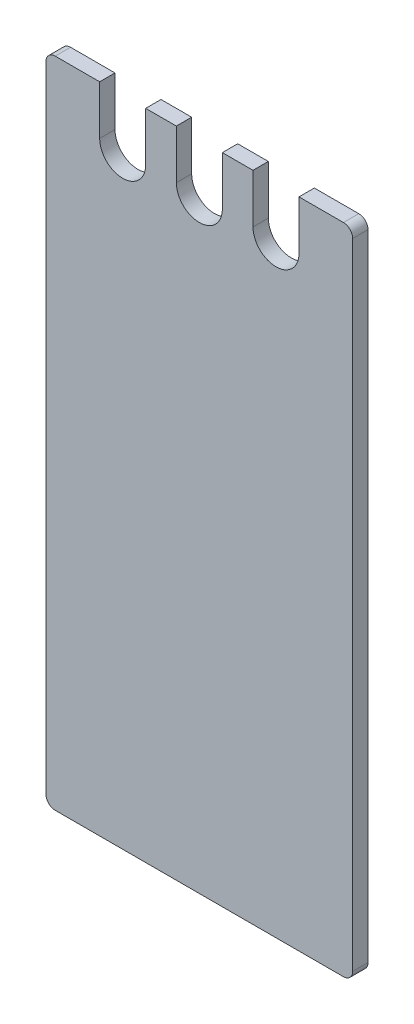
ISO-10303-21;
HEADER;
FILE_DESCRIPTION(('STEP AP214'),'2;1');
FILE_NAME('part.step','',(''),(''),'','','');
FILE_SCHEMA(('AUTOMOTIVE_DESIGN { 1 0 10303 214 1 1 1 1 }'));
ENDSEC;
DATA;
#1=APPLICATION_CONTEXT('core data for automotive mechanical design processes');
#2=APPLICATION_PROTOCOL_DEFINITION('international standard','automotive_design',2000,#1);
#3=PRODUCT_CONTEXT('',#1,'mechanical');
#4=PRODUCT('Part','Part','',(#3));
#5=PRODUCT_RELATED_PRODUCT_CATEGORY('part','',(#4));
#6=PRODUCT_DEFINITION_FORMATION('','',#4);
#7=PRODUCT_DEFINITION_CONTEXT('part definition',#1,'design');
#8=PRODUCT_DEFINITION('design','',#6,#7);
#9=PRODUCT_DEFINITION_SHAPE('','',#8);
#10=(LENGTH_UNIT() NAMED_UNIT(*) SI_UNIT(.MILLI.,.METRE.));
#11=(NAMED_UNIT(*) PLANE_ANGLE_UNIT() SI_UNIT($,.RADIAN.));
#12=(NAMED_UNIT(*) SI_UNIT($,.STERADIAN.) SOLID_ANGLE_UNIT());
#13=UNCERTAINTY_MEASURE_WITH_UNIT(LENGTH_MEASURE(1.E-05),#10,'distance_accuracy_value','');
#14=(GEOMETRIC_REPRESENTATION_CONTEXT(3) GLOBAL_UNCERTAINTY_ASSIGNED_CONTEXT((#13)) GLOBAL_UNIT_ASSIGNED_CONTEXT((#10,
#11,#12)) REPRESENTATION_CONTEXT('',''));
#15=CARTESIAN_POINT('',(0.,0.,0.));
#16=DIRECTION('',(0.,0.,1.));
#17=DIRECTION('',(1.,0.,0.));
#18=AXIS2_PLACEMENT_3D('',#15,#16,#17);
#19=CARTESIAN_POINT('',(-7.49999999999998,213.,2.5));
#20=DIRECTION('',(-1.,0.,0.));
#21=DIRECTION('',(0.,-1.,0.));
#22=AXIS2_PLACEMENT_3D('',#19,#20,#21);
#23=PLANE('',#22);
#24=DIRECTION('',(0.,1.,0.));
#25=VECTOR('',#24,1.);
#26=CARTESIAN_POINT('',(-7.49999999999998,213.,-2.5));
#27=LINE('',#26,#25);
#28=CARTESIAN_POINT('',(-7.5,197.,-2.5));
#29=VERTEX_POINT('',#28);
#30=CARTESIAN_POINT('',(-7.49999999999998,213.,-2.5));
#31=VERTEX_POINT('',#30);
#32=EDGE_CURVE('E195',#29,#31,#27,.T.);
#33=ORIENTED_EDGE('',*,*,#32,.T.);
#34=DIRECTION('',(0.,0.,-1.));
#35=VECTOR('',#34,1.);
#36=CARTESIAN_POINT('',(-7.49999999999998,213.,2.5));
#37=LINE('',#36,#35);
#38=CARTESIAN_POINT('',(-7.49999999999998,213.,2.5));
#39=VERTEX_POINT('',#38);
#40=EDGE_CURVE('E176',#39,#31,#37,.T.);
#41=ORIENTED_EDGE('',*,*,#40,.F.);
#42=DIRECTION('',(0.,1.,0.));
#43=VECTOR('',#42,1.);
#44=CARTESIAN_POINT('',(-7.49999999999998,213.,2.5));
#45=LINE('',#44,#43);
#46=CARTESIAN_POINT('',(-7.5,197.,2.5));
#47=VERTEX_POINT('',#46);
#48=EDGE_CURVE('E182',#47,#39,#45,.T.);
#49=ORIENTED_EDGE('',*,*,#48,.F.);
#50=DIRECTION('',(0.,0.,-1.));
#51=VECTOR('',#50,1.);
#52=CARTESIAN_POINT('',(-7.5,197.,2.5));
#53=LINE('',#52,#51);
#54=EDGE_CURVE('E283',#47,#29,#53,.T.);
#55=ORIENTED_EDGE('',*,*,#54,.T.);
#56=EDGE_LOOP('',(#33,#41,#49,#55));
#57=FACE_BOUND('',#56,.T.);
#58=ADVANCED_FACE('F34',(#57),#23,.F.);
#59=CARTESIAN_POINT('',(-7.49999999999998,213.,2.5));
#60=DIRECTION('',(0.,-1.,0.));
#61=DIRECTION('',(1.,0.,0.));
#62=AXIS2_PLACEMENT_3D('',#59,#60,#61);
#63=PLANE('',#62);
#64=DIRECTION('',(-1.,0.,0.));
#65=VECTOR('',#64,1.);
#66=CARTESIAN_POINT('',(-7.49999999999998,213.,-2.5));
#67=LINE('',#66,#65);
#68=CARTESIAN_POINT('',(-17.5,213.,-2.5));
#69=VERTEX_POINT('',#68);
#70=EDGE_CURVE('E321',#31,#69,#67,.T.);
#71=ORIENTED_EDGE('',*,*,#70,.T.);
#72=DIRECTION('',(0.,0.,-1.));
#73=VECTOR('',#72,1.);
#74=CARTESIAN_POINT('',(-17.5,213.,2.5));
#75=LINE('',#74,#73);
#76=CARTESIAN_POINT('',(-17.5,213.,2.5));
#77=VERTEX_POINT('',#76);
#78=EDGE_CURVE('E179',#77,#69,#75,.T.);
#79=ORIENTED_EDGE('',*,*,#78,.F.);
#80=DIRECTION('',(-1.,0.,0.));
#81=VECTOR('',#80,1.);
#82=CARTESIAN_POINT('',(-7.49999999999998,213.,2.5));
#83=LINE('',#82,#81);
#84=EDGE_CURVE('E172',#39,#77,#83,.T.);
#85=ORIENTED_EDGE('',*,*,#84,.F.);
#86=ORIENTED_EDGE('',*,*,#40,.T.);
#87=EDGE_LOOP('',(#71,#79,#85,#86));
#88=FACE_BOUND('',#87,.T.);
#89=ADVANCED_FACE('F174',(#88),#63,.F.);
#90=CARTESIAN_POINT('',(-17.5,213.,2.5));
#91=DIRECTION('',(1.,0.,0.));
#92=DIRECTION('',(0.,0.,-1.));
#93=AXIS2_PLACEMENT_3D('',#90,#91,#92);
#94=PLANE('',#93);
#95=DIRECTION('',(0.,-1.,0.));
#96=VECTOR('',#95,1.);
#97=CARTESIAN_POINT('',(-17.5,213.,-2.5));
#98=LINE('',#97,#96);
#99=CARTESIAN_POINT('',(-17.5,197.,-2.5));
#100=VERTEX_POINT('',#99);
#101=EDGE_CURVE('E319',#69,#100,#98,.T.);
#102=ORIENTED_EDGE('',*,*,#101,.T.);
#103=DIRECTION('',(0.,0.,-1.));
#104=VECTOR('',#103,1.);
#105=CARTESIAN_POINT('',(-17.5,197.,2.5));
#106=LINE('',#105,#104);
#107=CARTESIAN_POINT('',(-17.5,197.,2.5));
#108=VERTEX_POINT('',#107);
#109=EDGE_CURVE('E201',#108,#100,#106,.T.);
#110=ORIENTED_EDGE('',*,*,#109,.F.);
#111=DIRECTION('',(0.,-1.,0.));
#112=VECTOR('',#111,1.);
#113=CARTESIAN_POINT('',(-17.5,213.,2.5));
#114=LINE('',#113,#112);
#115=EDGE_CURVE('E181',#77,#108,#114,.T.);
#116=ORIENTED_EDGE('',*,*,#115,.F.);
#117=ORIENTED_EDGE('',*,*,#78,.T.);
#118=EDGE_LOOP('',(#102,#110,#116,#117));
#119=FACE_BOUND('',#118,.T.);
#120=ADVANCED_FACE('F346',(#119),#94,.F.);
#121=CARTESIAN_POINT('',(-25.,197.,2.5));
#122=DIRECTION('',(0.,0.,-1.));
#123=DIRECTION('',(-1.,0.,0.));
#124=AXIS2_PLACEMENT_3D('',#121,#122,#123);
#125=CYLINDRICAL_SURFACE('',#124,7.5);
#126=CARTESIAN_POINT('',(-25.,197.,-2.5));
#127=DIRECTION('',(0.,0.,-1.));
#128=DIRECTION('',(1.,0.,0.));
#129=AXIS2_PLACEMENT_3D('',#126,#127,#128);
#130=CIRCLE('',#129,7.5);
#131=CARTESIAN_POINT('',(-32.5,197.,-2.5));
#132=VERTEX_POINT('',#131);
#133=EDGE_CURVE('E314',#100,#132,#130,.T.);
#134=ORIENTED_EDGE('',*,*,#133,.T.);
#135=DIRECTION('',(0.,0.,-1.));
#136=VECTOR('',#135,1.);
#137=CARTESIAN_POINT('',(-32.5,197.,2.5));
#138=LINE('',#137,#136);
#139=CARTESIAN_POINT('',(-32.5,197.,2.5));
#140=VERTEX_POINT('',#139);
#141=EDGE_CURVE('E305',#140,#132,#138,.T.);
#142=ORIENTED_EDGE('',*,*,#141,.F.);
#143=CARTESIAN_POINT('',(-25.,197.,2.5));
#144=DIRECTION('',(0.,0.,-1.));
#145=DIRECTION('',(1.,0.,0.));
#146=AXIS2_PLACEMENT_3D('',#143,#144,#145);
#147=CIRCLE('',#146,7.5);
#148=EDGE_CURVE('E315',#108,#140,#147,.T.);
#149=ORIENTED_EDGE('',*,*,#148,.F.);
#150=ORIENTED_EDGE('',*,*,#109,.T.);
#151=EDGE_LOOP('',(#134,#142,#149,#150));
#152=FACE_BOUND('',#151,.T.);
#153=ADVANCED_FACE('F312',(#152),#125,.F.);
#154=CARTESIAN_POINT('',(-32.5,213.,2.5));
#155=DIRECTION('',(-1.,0.,0.));
#156=DIRECTION('',(0.,-1.,0.));
#157=AXIS2_PLACEMENT_3D('',#154,#155,#156);
#158=PLANE('',#157);
#159=DIRECTION('',(0.,1.,0.));
#160=VECTOR('',#159,1.);
#161=CARTESIAN_POINT('',(-32.5,213.,-2.5));
#162=LINE('',#161,#160);
#163=CARTESIAN_POINT('',(-32.5,213.,-2.5));
#164=VERTEX_POINT('',#163);
#165=EDGE_CURVE('E264',#132,#164,#162,.T.);
#166=ORIENTED_EDGE('',*,*,#165,.T.);
#167=DIRECTION('',(0.,0.,-1.));
#168=VECTOR('',#167,1.);
#169=CARTESIAN_POINT('',(-32.5,213.,2.5));
#170=LINE('',#169,#168);
#171=CARTESIAN_POINT('',(-32.5,213.,2.5));
#172=VERTEX_POINT('',#171);
#173=EDGE_CURVE('E303',#172,#164,#170,.T.);
#174=ORIENTED_EDGE('',*,*,#173,.F.);
#175=DIRECTION('',(0.,1.,0.));
#176=VECTOR('',#175,1.);
#177=CARTESIAN_POINT('',(-32.5,213.,2.5));
#178=LINE('',#177,#176);
#179=EDGE_CURVE('E244',#140,#172,#178,.T.);
#180=ORIENTED_EDGE('',*,*,#179,.F.);
#181=ORIENTED_EDGE('',*,*,#141,.T.);
#182=EDGE_LOOP('',(#166,#174,#180,#181));
#183=FACE_BOUND('',#182,.T.);
#184=ADVANCED_FACE('F353',(#183),#158,.F.);
#185=CARTESIAN_POINT('',(-32.5,213.,2.5));
#186=DIRECTION('',(0.,-1.,0.));
#187=DIRECTION('',(1.,0.,0.));
#188=AXIS2_PLACEMENT_3D('',#185,#186,#187);
#189=PLANE('',#188);
#190=DIRECTION('',(-1.,0.,0.));
#191=VECTOR('',#190,1.);
#192=CARTESIAN_POINT('',(-32.5,213.,-2.5));
#193=LINE('',#192,#191);
#194=CARTESIAN_POINT('',(-47.,213.,-2.5));
#195=VERTEX_POINT('',#194);
#196=EDGE_CURVE('E239',#164,#195,#193,.T.);
#197=ORIENTED_EDGE('',*,*,#196,.T.);
#198=DIRECTION('',(0.,0.,-1.));
#199=VECTOR('',#198,1.);
#200=CARTESIAN_POINT('',(-47.,213.,2.5));
#201=LINE('',#200,#199);
#202=CARTESIAN_POINT('',(-47.,213.,2.5));
#203=VERTEX_POINT('',#202);
#204=EDGE_CURVE('E229',#195,#203,#201,.F.);
#205=ORIENTED_EDGE('',*,*,#204,.T.);
#206=DIRECTION('',(-1.,0.,0.));
#207=VECTOR('',#206,1.);
#208=CARTESIAN_POINT('',(-32.5,213.,2.5));
#209=LINE('',#208,#207);
#210=EDGE_CURVE('E237',#172,#203,#209,.T.);
#211=ORIENTED_EDGE('',*,*,#210,.F.);
#212=ORIENTED_EDGE('',*,*,#173,.T.);
#213=EDGE_LOOP('',(#197,#205,#211,#212));
#214=FACE_BOUND('',#213,.T.);
#215=ADVANCED_FACE('F235',(#214),#189,.F.);
#216=CARTESIAN_POINT('',(-50.,213.,2.5));
#217=DIRECTION('',(1.,0.,0.));
#218=DIRECTION('',(0.,0.,-1.));
#219=AXIS2_PLACEMENT_3D('',#216,#217,#218);
#220=PLANE('',#219);
#221=DIRECTION('',(0.,-1.,0.));
#222=VECTOR('',#221,1.);
#223=CARTESIAN_POINT('',(-50.,213.,2.5));
#224=LINE('',#223,#222);
#225=CARTESIAN_POINT('',(-50.,210.,2.5));
#226=VERTEX_POINT('',#225);
#227=CARTESIAN_POINT('',(-50.,3.,2.5));
#228=VERTEX_POINT('',#227);
#229=EDGE_CURVE('E246',#226,#228,#224,.T.);
#230=ORIENTED_EDGE('',*,*,#229,.F.);
#231=DIRECTION('',(0.,0.,-1.));
#232=VECTOR('',#231,1.);
#233=CARTESIAN_POINT('',(-50.,210.,2.5));
#234=LINE('',#233,#232);
#235=CARTESIAN_POINT('',(-50.,210.,-2.5));
#236=VERTEX_POINT('',#235);
#237=EDGE_CURVE('E226',#226,#236,#234,.T.);
#238=ORIENTED_EDGE('',*,*,#237,.T.);
#239=DIRECTION('',(0.,-1.,0.));
#240=VECTOR('',#239,1.);
#241=CARTESIAN_POINT('',(-50.,213.,-2.5));
#242=LINE('',#241,#240);
#243=CARTESIAN_POINT('',(-50.,3.,-2.5));
#244=VERTEX_POINT('',#243);
#245=EDGE_CURVE('E254',#236,#244,#242,.T.);
#246=ORIENTED_EDGE('',*,*,#245,.T.);
#247=DIRECTION('',(0.,0.,-1.));
#248=VECTOR('',#247,1.);
#249=CARTESIAN_POINT('',(-50.,3.,2.5));
#250=LINE('',#249,#248);
#251=EDGE_CURVE('E224',#244,#228,#250,.F.);
#252=ORIENTED_EDGE('',*,*,#251,.T.);
#253=EDGE_LOOP('',(#230,#238,#246,#252));
#254=FACE_BOUND('',#253,.T.);
#255=ADVANCED_FACE('F253',(#254),#220,.F.);
#256=CARTESIAN_POINT('',(-50.,0.,2.5));
#257=DIRECTION('',(0.,1.,0.));
#258=DIRECTION('',(0.,0.,1.));
#259=AXIS2_PLACEMENT_3D('',#256,#257,#258);
#260=PLANE('',#259);
#261=DIRECTION('',(1.,0.,0.));
#262=VECTOR('',#261,1.);
#263=CARTESIAN_POINT('',(-50.,0.,2.5));
#264=LINE('',#263,#262);
#265=CARTESIAN_POINT('',(-47.,0.,2.5));
#266=VERTEX_POINT('',#265);
#267=CARTESIAN_POINT('',(47.,0.,2.5));
#268=VERTEX_POINT('',#267);
#269=EDGE_CURVE('E341',#266,#268,#264,.T.);
#270=ORIENTED_EDGE('',*,*,#269,.F.);
#271=DIRECTION('',(0.,0.,-1.));
#272=VECTOR('',#271,1.);
#273=CARTESIAN_POINT('',(-47.,0.,2.5));
#274=LINE('',#273,#272);
#275=CARTESIAN_POINT('',(-47.,0.,-2.5));
#276=VERTEX_POINT('',#275);
#277=EDGE_CURVE('E11',#266,#276,#274,.T.);
#278=ORIENTED_EDGE('',*,*,#277,.T.);
#279=DIRECTION('',(1.,0.,0.));
#280=VECTOR('',#279,1.);
#281=CARTESIAN_POINT('',(-50.,0.,-2.5));
#282=LINE('',#281,#280);
#283=CARTESIAN_POINT('',(47.,0.,-2.5));
#284=VERTEX_POINT('',#283);
#285=EDGE_CURVE('E260',#276,#284,#282,.T.);
#286=ORIENTED_EDGE('',*,*,#285,.T.);
#287=DIRECTION('',(0.,0.,-1.));
#288=VECTOR('',#287,1.);
#289=CARTESIAN_POINT('',(47.,0.,2.5));
#290=LINE('',#289,#288);
#291=EDGE_CURVE('E42',#284,#268,#290,.F.);
#292=ORIENTED_EDGE('',*,*,#291,.T.);
#293=EDGE_LOOP('',(#270,#278,#286,#292));
#294=FACE_BOUND('',#293,.T.);
#295=ADVANCED_FACE('F374',(#294),#260,.F.);
#296=CARTESIAN_POINT('',(50.,0.,2.5));
#297=DIRECTION('',(-1.,0.,0.));
#298=DIRECTION('',(0.,0.,1.));
#299=AXIS2_PLACEMENT_3D('',#296,#297,#298);
#300=PLANE('',#299);
#301=DIRECTION('',(0.,1.,0.));
#302=VECTOR('',#301,1.);
#303=CARTESIAN_POINT('',(50.,0.,-2.5));
#304=LINE('',#303,#302);
#305=CARTESIAN_POINT('',(50.,3.,-2.5));
#306=VERTEX_POINT('',#305);
#307=CARTESIAN_POINT('',(50.,210.,-2.5));
#308=VERTEX_POINT('',#307);
#309=EDGE_CURVE('E262',#306,#308,#304,.T.);
#310=ORIENTED_EDGE('',*,*,#309,.T.);
#311=DIRECTION('',(0.,0.,-1.));
#312=VECTOR('',#311,1.);
#313=CARTESIAN_POINT('',(50.,210.,2.5));
#314=LINE('',#313,#312);
#315=CARTESIAN_POINT('',(50.,210.,2.5));
#316=VERTEX_POINT('',#315);
#317=EDGE_CURVE('E215',#308,#316,#314,.F.);
#318=ORIENTED_EDGE('',*,*,#317,.T.);
#319=DIRECTION('',(0.,1.,0.));
#320=VECTOR('',#319,1.);
#321=CARTESIAN_POINT('',(50.,0.,2.5));
#322=LINE('',#321,#320);
#323=CARTESIAN_POINT('',(50.,3.,2.5));
#324=VERTEX_POINT('',#323);
#325=EDGE_CURVE('E339',#324,#316,#322,.T.);
#326=ORIENTED_EDGE('',*,*,#325,.F.);
#327=DIRECTION('',(0.,0.,-1.));
#328=VECTOR('',#327,1.);
#329=CARTESIAN_POINT('',(50.,3.,2.5));
#330=LINE('',#329,#328);
#331=EDGE_CURVE('E212',#324,#306,#330,.T.);
#332=ORIENTED_EDGE('',*,*,#331,.T.);
#333=EDGE_LOOP('',(#310,#318,#326,#332));
#334=FACE_BOUND('',#333,.T.);
#335=ADVANCED_FACE('F380',(#334),#300,.F.);
#336=CARTESIAN_POINT('',(32.5,213.,2.5));
#337=DIRECTION('',(0.,-1.,0.));
#338=DIRECTION('',(0.,0.,-1.));
#339=AXIS2_PLACEMENT_3D('',#336,#337,#338);
#340=PLANE('',#339);
#341=DIRECTION('',(-1.,0.,0.));
#342=VECTOR('',#341,1.);
#343=CARTESIAN_POINT('',(32.5,213.,2.5));
#344=LINE('',#343,#342);
#345=CARTESIAN_POINT('',(47.,213.,2.5));
#346=VERTEX_POINT('',#345);
#347=CARTESIAN_POINT('',(32.5,213.,2.5));
#348=VERTEX_POINT('',#347);
#349=EDGE_CURVE('E337',#346,#348,#344,.T.);
#350=ORIENTED_EDGE('',*,*,#349,.F.);
#351=DIRECTION('',(0.,0.,-1.));
#352=VECTOR('',#351,1.);
#353=CARTESIAN_POINT('',(47.,213.,2.5));
#354=LINE('',#353,#352);
#355=CARTESIAN_POINT('',(47.,213.,-2.5));
#356=VERTEX_POINT('',#355);
#357=EDGE_CURVE('E196',#346,#356,#354,.T.);
#358=ORIENTED_EDGE('',*,*,#357,.T.);
#359=DIRECTION('',(-1.,0.,0.));
#360=VECTOR('',#359,1.);
#361=CARTESIAN_POINT('',(32.5,213.,-2.5));
#362=LINE('',#361,#360);
#363=CARTESIAN_POINT('',(32.5,213.,-2.5));
#364=VERTEX_POINT('',#363);
#365=EDGE_CURVE('E270',#356,#364,#362,.T.);
#366=ORIENTED_EDGE('',*,*,#365,.T.);
#367=DIRECTION('',(0.,0.,-1.));
#368=VECTOR('',#367,1.);
#369=CARTESIAN_POINT('',(32.5,213.,2.5));
#370=LINE('',#369,#368);
#371=EDGE_CURVE('E300',#348,#364,#370,.T.);
#372=ORIENTED_EDGE('',*,*,#371,.F.);
#373=EDGE_LOOP('',(#350,#358,#366,#372));
#374=FACE_BOUND('',#373,.T.);
#375=ADVANCED_FACE('F386',(#374),#340,.F.);
#376=CARTESIAN_POINT('',(32.5,213.,2.5));
#377=DIRECTION('',(1.,0.,0.));
#378=DIRECTION('',(0.,0.,-1.));
#379=AXIS2_PLACEMENT_3D('',#376,#377,#378);
#380=PLANE('',#379);
#381=DIRECTION('',(0.,-1.,0.));
#382=VECTOR('',#381,1.);
#383=CARTESIAN_POINT('',(32.5,213.,-2.5));
#384=LINE('',#383,#382);
#385=CARTESIAN_POINT('',(32.5,197.,-2.5));
#386=VERTEX_POINT('',#385);
#387=EDGE_CURVE('E272',#364,#386,#384,.T.);
#388=ORIENTED_EDGE('',*,*,#387,.T.);
#389=DIRECTION('',(0.,0.,-1.));
#390=VECTOR('',#389,1.);
#391=CARTESIAN_POINT('',(32.5,197.,2.5));
#392=LINE('',#391,#390);
#393=CARTESIAN_POINT('',(32.5,197.,2.5));
#394=VERTEX_POINT('',#393);
#395=EDGE_CURVE('E297',#394,#386,#392,.T.);
#396=ORIENTED_EDGE('',*,*,#395,.F.);
#397=DIRECTION('',(0.,-1.,0.));
#398=VECTOR('',#397,1.);
#399=CARTESIAN_POINT('',(32.5,213.,2.5));
#400=LINE('',#399,#398);
#401=EDGE_CURVE('E335',#348,#394,#400,.T.);
#402=ORIENTED_EDGE('',*,*,#401,.F.);
#403=ORIENTED_EDGE('',*,*,#371,.T.);
#404=EDGE_LOOP('',(#388,#396,#402,#403));
#405=FACE_BOUND('',#404,.T.);
#406=ADVANCED_FACE('F393',(#405),#380,.F.);
#407=CARTESIAN_POINT('',(25.,197.,2.5));
#408=DIRECTION('',(0.,0.,-1.));
#409=DIRECTION('',(-1.,0.,0.));
#410=AXIS2_PLACEMENT_3D('',#407,#408,#409);
#411=CYLINDRICAL_SURFACE('',#410,7.5);
#412=CARTESIAN_POINT('',(25.,197.,-2.5));
#413=DIRECTION('',(0.,0.,-1.));
#414=DIRECTION('',(1.,0.,0.));
#415=AXIS2_PLACEMENT_3D('',#412,#413,#414);
#416=CIRCLE('',#415,7.5);
#417=CARTESIAN_POINT('',(17.5,197.,-2.5));
#418=VERTEX_POINT('',#417);
#419=EDGE_CURVE('E274',#386,#418,#416,.T.);
#420=ORIENTED_EDGE('',*,*,#419,.T.);
#421=DIRECTION('',(0.,0.,-1.));
#422=VECTOR('',#421,1.);
#423=CARTESIAN_POINT('',(17.5,197.,2.5));
#424=LINE('',#423,#422);
#425=CARTESIAN_POINT('',(17.5,197.,2.5));
#426=VERTEX_POINT('',#425);
#427=EDGE_CURVE('E294',#426,#418,#424,.T.);
#428=ORIENTED_EDGE('',*,*,#427,.F.);
#429=CARTESIAN_POINT('',(25.,197.,2.5));
#430=DIRECTION('',(0.,0.,-1.));
#431=DIRECTION('',(1.,0.,0.));
#432=AXIS2_PLACEMENT_3D('',#429,#430,#431);
#433=CIRCLE('',#432,7.5);
#434=EDGE_CURVE('E333',#394,#426,#433,.T.);
#435=ORIENTED_EDGE('',*,*,#434,.F.);
#436=ORIENTED_EDGE('',*,*,#395,.T.);
#437=EDGE_LOOP('',(#420,#428,#435,#436));
#438=FACE_BOUND('',#437,.T.);
#439=ADVANCED_FACE('F397',(#438),#411,.F.);
#440=CARTESIAN_POINT('',(17.5,213.,2.5));
#441=DIRECTION('',(-1.,0.,0.));
#442=DIRECTION('',(0.,-1.,0.));
#443=AXIS2_PLACEMENT_3D('',#440,#441,#442);
#444=PLANE('',#443);
#445=DIRECTION('',(0.,1.,0.));
#446=VECTOR('',#445,1.);
#447=CARTESIAN_POINT('',(17.5,213.,-2.5));
#448=LINE('',#447,#446);
#449=CARTESIAN_POINT('',(17.5,213.,-2.5));
#450=VERTEX_POINT('',#449);
#451=EDGE_CURVE('E276',#418,#450,#448,.T.);
#452=ORIENTED_EDGE('',*,*,#451,.T.);
#453=DIRECTION('',(0.,0.,-1.));
#454=VECTOR('',#453,1.);
#455=CARTESIAN_POINT('',(17.5,213.,2.5));
#456=LINE('',#455,#454);
#457=CARTESIAN_POINT('',(17.5,213.,2.5));
#458=VERTEX_POINT('',#457);
#459=EDGE_CURVE('E291',#458,#450,#456,.T.);
#460=ORIENTED_EDGE('',*,*,#459,.F.);
#461=DIRECTION('',(0.,1.,0.));
#462=VECTOR('',#461,1.);
#463=CARTESIAN_POINT('',(17.5,213.,2.5));
#464=LINE('',#463,#462);
#465=EDGE_CURVE('E331',#426,#458,#464,.T.);
#466=ORIENTED_EDGE('',*,*,#465,.F.);
#467=ORIENTED_EDGE('',*,*,#427,.T.);
#468=EDGE_LOOP('',(#452,#460,#466,#467));
#469=FACE_BOUND('',#468,.T.);
#470=ADVANCED_FACE('F404',(#469),#444,.F.);
#471=CARTESIAN_POINT('',(7.5,213.,2.5));
#472=DIRECTION('',(0.,-1.,0.));
#473=DIRECTION('',(0.,0.,-1.));
#474=AXIS2_PLACEMENT_3D('',#471,#472,#473);
#475=PLANE('',#474);
#476=DIRECTION('',(-1.,0.,0.));
#477=VECTOR('',#476,1.);
#478=CARTESIAN_POINT('',(7.5,213.,-2.5));
#479=LINE('',#478,#477);
#480=CARTESIAN_POINT('',(7.5,213.,-2.5));
#481=VERTEX_POINT('',#480);
#482=EDGE_CURVE('E278',#450,#481,#479,.T.);
#483=ORIENTED_EDGE('',*,*,#482,.T.);
#484=DIRECTION('',(0.,0.,-1.));
#485=VECTOR('',#484,1.);
#486=CARTESIAN_POINT('',(7.5,213.,2.5));
#487=LINE('',#486,#485);
#488=CARTESIAN_POINT('',(7.5,213.,2.5));
#489=VERTEX_POINT('',#488);
#490=EDGE_CURVE('E288',#489,#481,#487,.T.);
#491=ORIENTED_EDGE('',*,*,#490,.F.);
#492=DIRECTION('',(-1.,0.,0.));
#493=VECTOR('',#492,1.);
#494=CARTESIAN_POINT('',(7.5,213.,2.5));
#495=LINE('',#494,#493);
#496=EDGE_CURVE('E329',#458,#489,#495,.T.);
#497=ORIENTED_EDGE('',*,*,#496,.F.);
#498=ORIENTED_EDGE('',*,*,#459,.T.);
#499=EDGE_LOOP('',(#483,#491,#497,#498));
#500=FACE_BOUND('',#499,.T.);
#501=ADVANCED_FACE('F407',(#500),#475,.F.);
#502=CARTESIAN_POINT('',(7.5,213.,2.5));
#503=DIRECTION('',(1.,0.,0.));
#504=DIRECTION('',(0.,1.,0.));
#505=AXIS2_PLACEMENT_3D('',#502,#503,#504);
#506=PLANE('',#505);
#507=DIRECTION('',(0.,-1.,0.));
#508=VECTOR('',#507,1.);
#509=CARTESIAN_POINT('',(7.5,213.,-2.5));
#510=LINE('',#509,#508);
#511=CARTESIAN_POINT('',(7.5,197.,-2.5));
#512=VERTEX_POINT('',#511);
#513=EDGE_CURVE('E280',#481,#512,#510,.T.);
#514=ORIENTED_EDGE('',*,*,#513,.T.);
#515=DIRECTION('',(0.,0.,-1.));
#516=VECTOR('',#515,1.);
#517=CARTESIAN_POINT('',(7.5,197.,2.5));
#518=LINE('',#517,#516);
#519=CARTESIAN_POINT('',(7.5,197.,2.5));
#520=VERTEX_POINT('',#519);
#521=EDGE_CURVE('E285',#520,#512,#518,.T.);
#522=ORIENTED_EDGE('',*,*,#521,.F.);
#523=DIRECTION('',(0.,-1.,0.));
#524=VECTOR('',#523,1.);
#525=CARTESIAN_POINT('',(7.5,213.,2.5));
#526=LINE('',#525,#524);
#527=EDGE_CURVE('E327',#489,#520,#526,.T.);
#528=ORIENTED_EDGE('',*,*,#527,.F.);
#529=ORIENTED_EDGE('',*,*,#490,.T.);
#530=EDGE_LOOP('',(#514,#522,#528,#529));
#531=FACE_BOUND('',#530,.T.);
#532=ADVANCED_FACE('F412',(#531),#506,.F.);
#533=CARTESIAN_POINT('',(0.,197.,2.5));
#534=DIRECTION('',(0.,0.,-1.));
#535=DIRECTION('',(-1.,0.,0.));
#536=AXIS2_PLACEMENT_3D('',#533,#534,#535);
#537=CYLINDRICAL_SURFACE('',#536,7.5);
#538=CARTESIAN_POINT('',(0.,197.,-2.5));
#539=DIRECTION('',(0.,0.,-1.));
#540=DIRECTION('',(1.,0.,0.));
#541=AXIS2_PLACEMENT_3D('',#538,#539,#540);
#542=CIRCLE('',#541,7.5);
#543=EDGE_CURVE('E192',#512,#29,#542,.T.);
#544=ORIENTED_EDGE('',*,*,#543,.T.);
#545=ORIENTED_EDGE('',*,*,#54,.F.);
#546=CARTESIAN_POINT('',(0.,197.,2.5));
#547=DIRECTION('',(0.,0.,-1.));
#548=DIRECTION('',(1.,0.,0.));
#549=AXIS2_PLACEMENT_3D('',#546,#547,#548);
#550=CIRCLE('',#549,7.5);
#551=EDGE_CURVE('E188',#520,#47,#550,.T.);
#552=ORIENTED_EDGE('',*,*,#551,.F.);
#553=ORIENTED_EDGE('',*,*,#521,.T.);
#554=EDGE_LOOP('',(#544,#545,#552,#553));
#555=FACE_BOUND('',#554,.T.);
#556=ADVANCED_FACE('F415',(#555),#537,.F.);
#557=CARTESIAN_POINT('',(0.,197.,2.5));
#558=DIRECTION('',(0.,0.,1.));
#559=DIRECTION('',(1.,0.,0.));
#560=AXIS2_PLACEMENT_3D('',#557,#558,#559);
#561=PLANE('',#560);
#562=ORIENTED_EDGE('',*,*,#325,.T.);
#563=CARTESIAN_POINT('',(47.,210.,2.5));
#564=DIRECTION('',(0.,0.,1.));
#565=DIRECTION('',(1.,0.,0.));
#566=AXIS2_PLACEMENT_3D('',#563,#564,#565);
#567=CIRCLE('',#566,3.);
#568=EDGE_CURVE('E222',#316,#346,#567,.T.);
#569=ORIENTED_EDGE('',*,*,#568,.T.);
#570=ORIENTED_EDGE('',*,*,#349,.T.);
#571=ORIENTED_EDGE('',*,*,#401,.T.);
#572=ORIENTED_EDGE('',*,*,#434,.T.);
#573=ORIENTED_EDGE('',*,*,#465,.T.);
#574=ORIENTED_EDGE('',*,*,#496,.T.);
#575=ORIENTED_EDGE('',*,*,#527,.T.);
#576=ORIENTED_EDGE('',*,*,#551,.T.);
#577=ORIENTED_EDGE('',*,*,#48,.T.);
#578=ORIENTED_EDGE('',*,*,#84,.T.);
#579=ORIENTED_EDGE('',*,*,#115,.T.);
#580=ORIENTED_EDGE('',*,*,#148,.T.);
#581=ORIENTED_EDGE('',*,*,#179,.T.);
#582=ORIENTED_EDGE('',*,*,#210,.T.);
#583=CARTESIAN_POINT('',(-47.,210.,2.5));
#584=DIRECTION('',(0.,0.,1.));
#585=DIRECTION('',(1.,0.,0.));
#586=AXIS2_PLACEMENT_3D('',#583,#584,#585);
#587=CIRCLE('',#586,3.);
#588=EDGE_CURVE('E220',#203,#226,#587,.T.);
#589=ORIENTED_EDGE('',*,*,#588,.T.);
#590=ORIENTED_EDGE('',*,*,#229,.T.);
#591=CARTESIAN_POINT('',(-47.,3.,2.5));
#592=DIRECTION('',(0.,0.,1.));
#593=DIRECTION('',(1.,0.,0.));
#594=AXIS2_PLACEMENT_3D('',#591,#592,#593);
#595=CIRCLE('',#594,3.);
#596=EDGE_CURVE('E55',#228,#266,#595,.T.);
#597=ORIENTED_EDGE('',*,*,#596,.T.);
#598=ORIENTED_EDGE('',*,*,#269,.T.);
#599=CARTESIAN_POINT('',(47.,3.,2.5));
#600=DIRECTION('',(0.,0.,1.));
#601=DIRECTION('',(1.,0.,0.));
#602=AXIS2_PLACEMENT_3D('',#599,#600,#601);
#603=CIRCLE('',#602,3.);
#604=EDGE_CURVE('E217',#268,#324,#603,.T.);
#605=ORIENTED_EDGE('',*,*,#604,.T.);
#606=EDGE_LOOP('',(#562,#569,#570,#571,#572,#573,#574,#575,#576,#577,#578,#579,#580,#581,#582,
#589,#590,#597,#598,#605));
#607=FACE_BOUND('',#606,.T.);
#608=ADVANCED_FACE('F186',(#607),#561,.T.);
#609=CARTESIAN_POINT('',(0.,197.,-2.5));
#610=DIRECTION('',(0.,0.,1.));
#611=DIRECTION('',(1.,0.,0.));
#612=AXIS2_PLACEMENT_3D('',#609,#610,#611);
#613=PLANE('',#612);
#614=ORIENTED_EDGE('',*,*,#365,.F.);
#615=CARTESIAN_POINT('',(47.,210.,-2.5));
#616=DIRECTION('',(0.,0.,1.));
#617=DIRECTION('',(1.,0.,0.));
#618=AXIS2_PLACEMENT_3D('',#615,#616,#617);
#619=CIRCLE('',#618,3.);
#620=EDGE_CURVE('E210',#356,#308,#619,.F.);
#621=ORIENTED_EDGE('',*,*,#620,.T.);
#622=ORIENTED_EDGE('',*,*,#309,.F.);
#623=CARTESIAN_POINT('',(47.,3.,-2.5));
#624=DIRECTION('',(0.,0.,1.));
#625=DIRECTION('',(1.,0.,0.));
#626=AXIS2_PLACEMENT_3D('',#623,#624,#625);
#627=CIRCLE('',#626,3.);
#628=EDGE_CURVE('E199',#306,#284,#627,.F.);
#629=ORIENTED_EDGE('',*,*,#628,.T.);
#630=ORIENTED_EDGE('',*,*,#285,.F.);
#631=CARTESIAN_POINT('',(-47.,3.,-2.5));
#632=DIRECTION('',(0.,0.,1.));
#633=DIRECTION('',(1.,0.,0.));
#634=AXIS2_PLACEMENT_3D('',#631,#632,#633);
#635=CIRCLE('',#634,3.);
#636=EDGE_CURVE('E206',#276,#244,#635,.F.);
#637=ORIENTED_EDGE('',*,*,#636,.T.);
#638=ORIENTED_EDGE('',*,*,#245,.F.);
#639=CARTESIAN_POINT('',(-47.,210.,-2.5));
#640=DIRECTION('',(0.,0.,1.));
#641=DIRECTION('',(1.,0.,0.));
#642=AXIS2_PLACEMENT_3D('',#639,#640,#641);
#643=CIRCLE('',#642,3.);
#644=EDGE_CURVE('E208',#236,#195,#643,.F.);
#645=ORIENTED_EDGE('',*,*,#644,.T.);
#646=ORIENTED_EDGE('',*,*,#196,.F.);
#647=ORIENTED_EDGE('',*,*,#165,.F.);
#648=ORIENTED_EDGE('',*,*,#133,.F.);
#649=ORIENTED_EDGE('',*,*,#101,.F.);
#650=ORIENTED_EDGE('',*,*,#70,.F.);
#651=ORIENTED_EDGE('',*,*,#32,.F.);
#652=ORIENTED_EDGE('',*,*,#543,.F.);
#653=ORIENTED_EDGE('',*,*,#513,.F.);
#654=ORIENTED_EDGE('',*,*,#482,.F.);
#655=ORIENTED_EDGE('',*,*,#451,.F.);
#656=ORIENTED_EDGE('',*,*,#419,.F.);
#657=ORIENTED_EDGE('',*,*,#387,.F.);
#658=EDGE_LOOP('',(#614,#621,#622,#629,#630,#637,#638,#645,#646,#647,#648,#649,#650,#651,#652,
#653,#654,#655,#656,#657));
#659=FACE_BOUND('',#658,.T.);
#660=ADVANCED_FACE('F258',(#659),#613,.F.);
#661=CARTESIAN_POINT('',(47.,210.,2.5));
#662=DIRECTION('',(0.,0.,-1.));
#663=DIRECTION('',(-1.,0.,0.));
#664=AXIS2_PLACEMENT_3D('',#661,#662,#663);
#665=CYLINDRICAL_SURFACE('',#664,3.);
#666=ORIENTED_EDGE('',*,*,#568,.F.);
#667=ORIENTED_EDGE('',*,*,#317,.F.);
#668=ORIENTED_EDGE('',*,*,#620,.F.);
#669=ORIENTED_EDGE('',*,*,#357,.F.);
#670=EDGE_LOOP('',(#666,#667,#668,#669));
#671=FACE_BOUND('',#670,.T.);
#672=ADVANCED_FACE('F361',(#671),#665,.T.);
#673=CARTESIAN_POINT('',(-47.,210.,2.5));
#674=DIRECTION('',(0.,0.,-1.));
#675=DIRECTION('',(-1.,0.,0.));
#676=AXIS2_PLACEMENT_3D('',#673,#674,#675);
#677=CYLINDRICAL_SURFACE('',#676,3.);
#678=ORIENTED_EDGE('',*,*,#588,.F.);
#679=ORIENTED_EDGE('',*,*,#204,.F.);
#680=ORIENTED_EDGE('',*,*,#644,.F.);
#681=ORIENTED_EDGE('',*,*,#237,.F.);
#682=EDGE_LOOP('',(#678,#679,#680,#681));
#683=FACE_BOUND('',#682,.T.);
#684=ADVANCED_FACE('F249',(#683),#677,.T.);
#685=CARTESIAN_POINT('',(-47.,3.,2.5));
#686=DIRECTION('',(0.,0.,-1.));
#687=DIRECTION('',(-1.,0.,0.));
#688=AXIS2_PLACEMENT_3D('',#685,#686,#687);
#689=CYLINDRICAL_SURFACE('',#688,3.);
#690=ORIENTED_EDGE('',*,*,#596,.F.);
#691=ORIENTED_EDGE('',*,*,#251,.F.);
#692=ORIENTED_EDGE('',*,*,#636,.F.);
#693=ORIENTED_EDGE('',*,*,#277,.F.);
#694=EDGE_LOOP('',(#690,#691,#692,#693));
#695=FACE_BOUND('',#694,.T.);
#696=ADVANCED_FACE('F366',(#695),#689,.T.);
#697=CARTESIAN_POINT('',(47.,3.,2.5));
#698=DIRECTION('',(0.,0.,-1.));
#699=DIRECTION('',(-1.,0.,0.));
#700=AXIS2_PLACEMENT_3D('',#697,#698,#699);
#701=CYLINDRICAL_SURFACE('',#700,3.);
#702=ORIENTED_EDGE('',*,*,#604,.F.);
#703=ORIENTED_EDGE('',*,*,#291,.F.);
#704=ORIENTED_EDGE('',*,*,#628,.F.);
#705=ORIENTED_EDGE('',*,*,#331,.F.);
#706=EDGE_LOOP('',(#702,#703,#704,#705));
#707=FACE_BOUND('',#706,.T.);
#708=ADVANCED_FACE('F36',(#707),#701,.T.);
#709=CLOSED_SHELL('',(#58,#89,#120,#153,#184,#215,#255,#295,#335,#375,#406,#439,#470,#501,#532,
#556,#608,#660,#672,#684,#696,#708));
#710=MANIFOLD_SOLID_BREP('B2',#709);
#711=ADVANCED_BREP_SHAPE_REPRESENTATION('',(#18,#710),#14);
#712=SHAPE_DEFINITION_REPRESENTATION(#9,#711);
ENDSEC;
END-ISO-10303-21;
